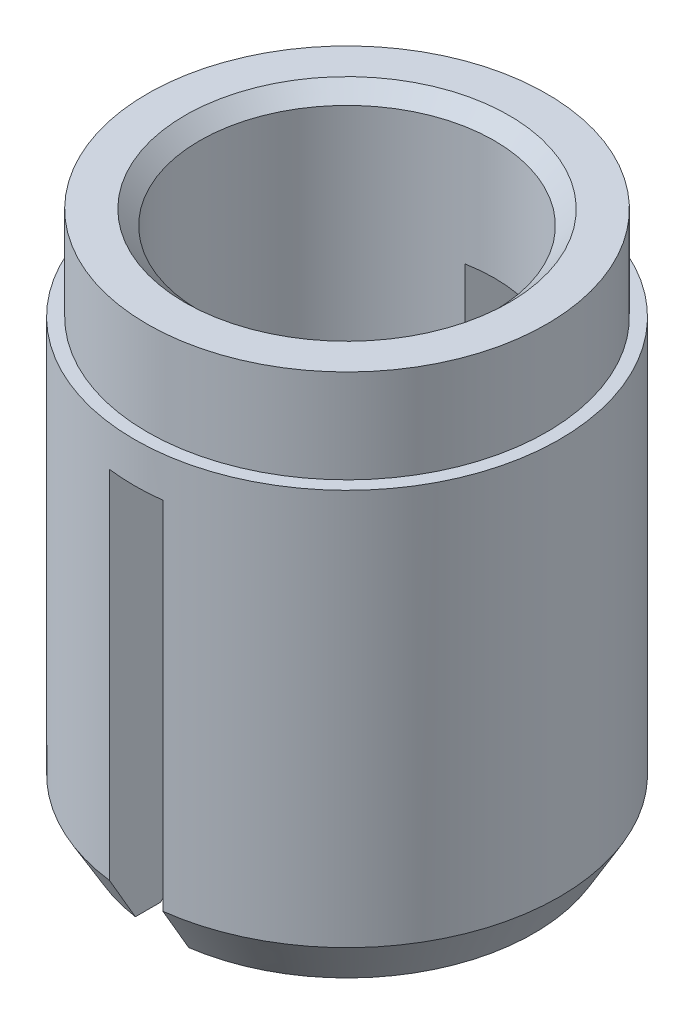
ISO-10303-21;
HEADER;
FILE_DESCRIPTION(('STEP AP214'),'2;1');
FILE_NAME('part.step','',(''),(''),'','','');
FILE_SCHEMA(('AUTOMOTIVE_DESIGN { 1 0 10303 214 1 1 1 1 }'));
ENDSEC;
DATA;
#1=APPLICATION_CONTEXT('core data for automotive mechanical design processes');
#2=APPLICATION_PROTOCOL_DEFINITION('international standard','automotive_design',2000,#1);
#3=PRODUCT_CONTEXT('',#1,'mechanical');
#4=PRODUCT('Part','Part','',(#3));
#5=PRODUCT_RELATED_PRODUCT_CATEGORY('part','',(#4));
#6=PRODUCT_DEFINITION_FORMATION('','',#4);
#7=PRODUCT_DEFINITION_CONTEXT('part definition',#1,'design');
#8=PRODUCT_DEFINITION('design','',#6,#7);
#9=PRODUCT_DEFINITION_SHAPE('','',#8);
#10=(LENGTH_UNIT() NAMED_UNIT(*) SI_UNIT(.MILLI.,.METRE.));
#11=(NAMED_UNIT(*) PLANE_ANGLE_UNIT() SI_UNIT($,.RADIAN.));
#12=(NAMED_UNIT(*) SI_UNIT($,.STERADIAN.) SOLID_ANGLE_UNIT());
#13=UNCERTAINTY_MEASURE_WITH_UNIT(LENGTH_MEASURE(1.E-05),#10,'distance_accuracy_value','');
#14=(GEOMETRIC_REPRESENTATION_CONTEXT(3) GLOBAL_UNCERTAINTY_ASSIGNED_CONTEXT((#13)) GLOBAL_UNIT_ASSIGNED_CONTEXT((#10,
#11,#12)) REPRESENTATION_CONTEXT('',''));
#15=CARTESIAN_POINT('',(0.,0.,0.));
#16=DIRECTION('',(0.,0.,1.));
#17=DIRECTION('',(1.,0.,0.));
#18=AXIS2_PLACEMENT_3D('',#15,#16,#17);
#19=CARTESIAN_POINT('',(0.,3.175,0.));
#20=DIRECTION('',(0.,-1.,0.));
#21=DIRECTION('',(0.,0.,-1.));
#22=AXIS2_PLACEMENT_3D('',#19,#20,#21);
#23=CYLINDRICAL_SURFACE('',#22,2.5273);
#24=CARTESIAN_POINT('',(0.,2.06375,0.));
#25=DIRECTION('',(0.,1.,0.));
#26=DIRECTION('',(0.,0.,1.));
#27=AXIS2_PLACEMENT_3D('',#24,#25,#26);
#28=CIRCLE('',#27,2.5273);
#29=CARTESIAN_POINT('',(0.,2.06375,2.5273));
#30=VERTEX_POINT('',#29);
#31=EDGE_CURVE('E163',#30,#30,#28,.T.);
#32=ORIENTED_EDGE('',*,*,#31,.F.);
#33=EDGE_LOOP('',(#32));
#34=FACE_BOUND('',#33,.T.);
#35=DIRECTION('',(0.,-1.,0.));
#36=VECTOR('',#35,1.);
#37=CARTESIAN_POINT('',(0.317500000000001,3.175,-2.50727721642422));
#38=LINE('',#37,#36);
#39=CARTESIAN_POINT('',(0.3175,1.5875,-2.50727721642422));
#40=VERTEX_POINT('',#39);
#41=CARTESIAN_POINT('',(0.317499999999999,-2.64707091385299,-2.50727721642422));
#42=VERTEX_POINT('',#41);
#43=EDGE_CURVE('E51',#40,#42,#38,.T.);
#44=ORIENTED_EDGE('',*,*,#43,.F.);
#45=CARTESIAN_POINT('',(0.,1.5875,0.));
#46=DIRECTION('',(0.,-1.,0.));
#47=DIRECTION('',(0.,0.,-1.));
#48=AXIS2_PLACEMENT_3D('',#45,#46,#47);
#49=CIRCLE('',#48,2.5273);
#50=CARTESIAN_POINT('',(-0.3175,1.5875,-2.50727721642422));
#51=VERTEX_POINT('',#50);
#52=EDGE_CURVE('E225',#51,#40,#49,.T.);
#53=ORIENTED_EDGE('',*,*,#52,.F.);
#54=DIRECTION('',(0.,-1.,0.));
#55=VECTOR('',#54,1.);
#56=CARTESIAN_POINT('',(-0.3175,3.175,-2.50727721642422));
#57=LINE('',#56,#55);
#58=CARTESIAN_POINT('',(-0.317499999999999,-2.64707091385299,-2.50727721642422));
#59=VERTEX_POINT('',#58);
#60=EDGE_CURVE('E217',#59,#51,#57,.F.);
#61=ORIENTED_EDGE('',*,*,#60,.F.);
#62=CARTESIAN_POINT('',(0.,-2.64707091385299,0.));
#63=DIRECTION('',(0.,1.,0.));
#64=DIRECTION('',(0.,0.,1.));
#65=AXIS2_PLACEMENT_3D('',#62,#63,#64);
#66=CIRCLE('',#65,2.5273);
#67=CARTESIAN_POINT('',(-0.317499999999999,-2.64707091385299,2.50727721642422));
#68=VERTEX_POINT('',#67);
#69=EDGE_CURVE('E159',#59,#68,#66,.T.);
#70=ORIENTED_EDGE('',*,*,#69,.T.);
#71=DIRECTION('',(0.,-1.,0.));
#72=VECTOR('',#71,1.);
#73=CARTESIAN_POINT('',(-0.3175,3.175,2.50727721642422));
#74=LINE('',#73,#72);
#75=CARTESIAN_POINT('',(-0.3175,1.5875,2.50727721642422));
#76=VERTEX_POINT('',#75);
#77=EDGE_CURVE('E273',#76,#68,#74,.T.);
#78=ORIENTED_EDGE('',*,*,#77,.F.);
#79=CARTESIAN_POINT('',(0.3175,1.5875,2.50727721642422));
#80=VERTEX_POINT('',#79);
#81=EDGE_CURVE('E154',#80,#76,#49,.T.);
#82=ORIENTED_EDGE('',*,*,#81,.F.);
#83=DIRECTION('',(0.,-1.,0.));
#84=VECTOR('',#83,1.);
#85=CARTESIAN_POINT('',(0.317500000000001,3.175,2.50727721642422));
#86=LINE('',#85,#84);
#87=CARTESIAN_POINT('',(0.317499999999999,-2.64707091385299,2.50727721642422));
#88=VERTEX_POINT('',#87);
#89=EDGE_CURVE('E250',#88,#80,#86,.F.);
#90=ORIENTED_EDGE('',*,*,#89,.F.);
#91=EDGE_CURVE('E162',#88,#42,#66,.T.);
#92=ORIENTED_EDGE('',*,*,#91,.T.);
#93=EDGE_LOOP('',(#44,#53,#61,#70,#78,#82,#90,#92));
#94=FACE_BOUND('',#93,.T.);
#95=ADVANCED_FACE('F35',(#34,#94),#23,.T.);
#96=CARTESIAN_POINT('',(0.,3.175,0.));
#97=DIRECTION('',(0.,-1.,0.));
#98=DIRECTION('',(0.,0.,-1.));
#99=AXIS2_PLACEMENT_3D('',#96,#97,#98);
#100=CYLINDRICAL_SURFACE('',#99,1.7526);
#101=CARTESIAN_POINT('',(0.,3.00277247766634,0.));
#102=DIRECTION('',(0.,1.,0.));
#103=DIRECTION('',(0.,0.,1.));
#104=AXIS2_PLACEMENT_3D('',#101,#102,#103);
#105=CIRCLE('',#104,1.7526);
#106=CARTESIAN_POINT('',(0.,3.00277247766634,1.7526));
#107=VERTEX_POINT('',#106);
#108=EDGE_CURVE('E157',#107,#107,#105,.F.);
#109=ORIENTED_EDGE('',*,*,#108,.F.);
#110=EDGE_LOOP('',(#109));
#111=FACE_BOUND('',#110,.T.);
#112=CARTESIAN_POINT('',(0.,1.5875,0.));
#113=DIRECTION('',(0.,-1.,0.));
#114=DIRECTION('',(0.,0.,-1.));
#115=AXIS2_PLACEMENT_3D('',#112,#113,#114);
#116=CIRCLE('',#115,1.7526);
#117=CARTESIAN_POINT('',(0.3175,1.5875,1.723601029821));
#118=VERTEX_POINT('',#117);
#119=CARTESIAN_POINT('',(-0.3175,1.5875,1.723601029821));
#120=VERTEX_POINT('',#119);
#121=EDGE_CURVE('E11',#118,#120,#116,.T.);
#122=ORIENTED_EDGE('',*,*,#121,.T.);
#123=DIRECTION('',(0.,-1.,0.));
#124=VECTOR('',#123,1.);
#125=CARTESIAN_POINT('',(-0.3175,3.175,1.723601029821));
#126=LINE('',#125,#124);
#127=CARTESIAN_POINT('',(-0.317499999999999,-3.00277247766634,1.723601029821));
#128=VERTEX_POINT('',#127);
#129=EDGE_CURVE('E222',#120,#128,#126,.T.);
#130=ORIENTED_EDGE('',*,*,#129,.T.);
#131=CARTESIAN_POINT('',(0.,-3.00277247766634,0.));
#132=DIRECTION('',(0.,-1.,0.));
#133=DIRECTION('',(0.,0.,-1.));
#134=AXIS2_PLACEMENT_3D('',#131,#132,#133);
#135=CIRCLE('',#134,1.7526);
#136=CARTESIAN_POINT('',(-0.317499999999999,-3.00277247766634,-1.723601029821));
#137=VERTEX_POINT('',#136);
#138=EDGE_CURVE('E151',#137,#128,#135,.F.);
#139=ORIENTED_EDGE('',*,*,#138,.F.);
#140=DIRECTION('',(0.,-1.,0.));
#141=VECTOR('',#140,1.);
#142=CARTESIAN_POINT('',(-0.3175,3.175,-1.723601029821));
#143=LINE('',#142,#141);
#144=CARTESIAN_POINT('',(-0.3175,1.5875,-1.723601029821));
#145=VERTEX_POINT('',#144);
#146=EDGE_CURVE('E216',#137,#145,#143,.F.);
#147=ORIENTED_EDGE('',*,*,#146,.T.);
#148=CARTESIAN_POINT('',(0.3175,1.5875,-1.723601029821));
#149=VERTEX_POINT('',#148);
#150=EDGE_CURVE('E40',#145,#149,#116,.T.);
#151=ORIENTED_EDGE('',*,*,#150,.T.);
#152=DIRECTION('',(0.,-1.,0.));
#153=VECTOR('',#152,1.);
#154=CARTESIAN_POINT('',(0.317500000000001,3.175,-1.723601029821));
#155=LINE('',#154,#153);
#156=CARTESIAN_POINT('',(0.317499999999999,-3.00277247766634,-1.723601029821));
#157=VERTEX_POINT('',#156);
#158=EDGE_CURVE('E272',#149,#157,#155,.T.);
#159=ORIENTED_EDGE('',*,*,#158,.T.);
#160=CARTESIAN_POINT('',(0.317499999999999,-3.00277247766634,1.723601029821));
#161=VERTEX_POINT('',#160);
#162=EDGE_CURVE('E148',#161,#157,#135,.F.);
#163=ORIENTED_EDGE('',*,*,#162,.F.);
#164=DIRECTION('',(0.,-1.,0.));
#165=VECTOR('',#164,1.);
#166=CARTESIAN_POINT('',(0.317500000000001,3.175,1.723601029821));
#167=LINE('',#166,#165);
#168=EDGE_CURVE('E128',#161,#118,#167,.F.);
#169=ORIENTED_EDGE('',*,*,#168,.T.);
#170=EDGE_LOOP('',(#122,#130,#139,#147,#151,#159,#163,#169));
#171=FACE_BOUND('',#170,.T.);
#172=ADVANCED_FACE('F244',(#111,#171),#100,.F.);
#173=CARTESIAN_POINT('',(0.,-3.175,0.));
#174=DIRECTION('',(0.,1.,0.));
#175=DIRECTION('',(0.,0.,1.));
#176=AXIS2_PLACEMENT_3D('',#173,#174,#175);
#177=PLANE('',#176);
#178=DIRECTION('',(0.,0.,-1.));
#179=VECTOR('',#178,1.);
#180=CARTESIAN_POINT('',(-0.317499999999999,-3.175,2.5273));
#181=LINE('',#180,#179);
#182=CARTESIAN_POINT('',(-0.317499999999999,-3.175,2.19970452561246));
#183=VERTEX_POINT('',#182);
#184=CARTESIAN_POINT('',(-0.317499999999999,-3.175,1.90153567665716));
#185=VERTEX_POINT('',#184);
#186=EDGE_CURVE('E251',#183,#185,#181,.T.);
#187=ORIENTED_EDGE('',*,*,#186,.F.);
#188=CARTESIAN_POINT('',(0.,-3.175,0.));
#189=DIRECTION('',(0.,1.,0.));
#190=DIRECTION('',(0.,0.,1.));
#191=AXIS2_PLACEMENT_3D('',#188,#189,#190);
#192=CIRCLE('',#191,2.22249999999999);
#193=CARTESIAN_POINT('',(-0.317499999999999,-3.175,-2.19970452561246));
#194=VERTEX_POINT('',#193);
#195=EDGE_CURVE('E164',#183,#194,#192,.F.);
#196=ORIENTED_EDGE('',*,*,#195,.T.);
#197=CARTESIAN_POINT('',(-0.317499999999999,-3.175,-1.90153567665716));
#198=VERTEX_POINT('',#197);
#199=EDGE_CURVE('E143',#198,#194,#181,.T.);
#200=ORIENTED_EDGE('',*,*,#199,.F.);
#201=CARTESIAN_POINT('',(0.,-3.175,0.));
#202=DIRECTION('',(0.,1.,0.));
#203=DIRECTION('',(0.,0.,1.));
#204=AXIS2_PLACEMENT_3D('',#201,#202,#203);
#205=CIRCLE('',#204,1.92786);
#206=EDGE_CURVE('E149',#198,#185,#205,.T.);
#207=ORIENTED_EDGE('',*,*,#206,.T.);
#208=EDGE_LOOP('',(#187,#196,#200,#207));
#209=FACE_BOUND('',#208,.T.);
#210=ADVANCED_FACE('F301',(#209),#177,.F.);
#211=DIRECTION('',(0.,0.,-1.));
#212=VECTOR('',#211,1.);
#213=CARTESIAN_POINT('',(0.317499999999999,-3.175,2.5273));
#214=LINE('',#213,#212);
#215=CARTESIAN_POINT('',(0.317499999999999,-3.175,-1.90153567665716));
#216=VERTEX_POINT('',#215);
#217=CARTESIAN_POINT('',(0.317499999999999,-3.175,-2.19970452561246));
#218=VERTEX_POINT('',#217);
#219=EDGE_CURVE('E144',#216,#218,#214,.T.);
#220=ORIENTED_EDGE('',*,*,#219,.T.);
#221=CARTESIAN_POINT('',(0.317499999999999,-3.175,2.19970452561246));
#222=VERTEX_POINT('',#221);
#223=EDGE_CURVE('E142',#218,#222,#192,.F.);
#224=ORIENTED_EDGE('',*,*,#223,.T.);
#225=CARTESIAN_POINT('',(0.317499999999999,-3.175,1.90153567665716));
#226=VERTEX_POINT('',#225);
#227=EDGE_CURVE('E59',#222,#226,#214,.T.);
#228=ORIENTED_EDGE('',*,*,#227,.T.);
#229=EDGE_CURVE('E140',#226,#216,#205,.T.);
#230=ORIENTED_EDGE('',*,*,#229,.T.);
#231=EDGE_LOOP('',(#220,#224,#228,#230));
#232=FACE_BOUND('',#231,.T.);
#233=ADVANCED_FACE('F139',(#232),#177,.F.);
#234=CARTESIAN_POINT('',(0.,-3.175,0.));
#235=DIRECTION('',(0.,-1.,0.));
#236=DIRECTION('',(0.,0.,-1.));
#237=AXIS2_PLACEMENT_3D('',#234,#235,#236);
#238=CONICAL_SURFACE('',#237,1.92786,0.794124809657422);
#239=CARTESIAN_POINT('',(-0.317499999999999,-5.46252179078327,4.24379877059259));
#240=CARTESIAN_POINT('',(-0.317499999999999,-5.31443369756718,4.09267816319377));
#241=CARTESIAN_POINT('',(-0.317499999999999,-5.16636439216439,3.94153912003483));
#242=CARTESIAN_POINT('',(-0.317499999999999,-4.87028399175995,3.6391926322881));
#243=CARTESIAN_POINT('',(-0.317499999999999,-4.72227289921881,3.48798518529094));
#244=CARTESIAN_POINT('',(-0.317499999999999,-4.42620490905018,3.18534291399634));
#245=CARTESIAN_POINT('',(-0.317499999999999,-4.27814809444854,3.03390800846909));
#246=CARTESIAN_POINT('',(-0.317499999999999,-3.98217928592847,2.73090777156038));
#247=CARTESIAN_POINT('',(-0.317499999999999,-3.83426728678755,2.57934244528274));
#248=CARTESIAN_POINT('',(-0.317499999999999,-3.54522819622682,2.28270864310126));
#249=CARTESIAN_POINT('',(-0.317499999999999,-3.40409100113407,2.13765001264966));
#250=CARTESIAN_POINT('',(-0.317499999999999,-3.12217114114297,1.8471575470586));
#251=CARTESIAN_POINT('',(-0.317499999999999,-2.98138851616585,1.70172367310175));
#252=CARTESIAN_POINT('',(-0.317499999999999,-2.77084187278659,1.48304818093191));
#253=CARTESIAN_POINT('',(-0.317499999999999,-2.70078406328826,1.41008974887184));
#254=CARTESIAN_POINT('',(-0.317499999999999,-2.56097999697679,1.26386886258359));
#255=CARTESIAN_POINT('',(-0.317499999999999,-2.49123375383245,1.19060639528377));
#256=CARTESIAN_POINT('',(-0.317499999999999,-2.35227069755042,1.04360612909373));
#257=CARTESIAN_POINT('',(-0.317499999999999,-2.28305378224454,0.969868427267113));
#258=CARTESIAN_POINT('',(-0.317499999999999,-2.1799765665701,0.858573034679068));
#259=CARTESIAN_POINT('',(-0.317499999999999,-2.14574338102152,0.821361087620718));
#260=CARTESIAN_POINT('',(-0.317499999999999,-2.07764602366073,0.746601478825787));
#261=CARTESIAN_POINT('',(-0.317499999999999,-2.04378184226508,0.709053825854196));
#262=CARTESIAN_POINT('',(-0.317499999999999,-1.992022051266,0.65078557631092));
#263=CARTESIAN_POINT('',(-0.317499999999999,-1.97392481065449,0.630244240661884));
#264=CARTESIAN_POINT('',(-0.317499999999999,-1.93794864645502,0.588967483297687));
#265=CARTESIAN_POINT('',(-0.317499999999999,-1.92006974355132,0.568232043517735));
#266=CARTESIAN_POINT('',(-0.317499999999999,-1.88447796272918,0.526361943117821));
#267=CARTESIAN_POINT('',(-0.317499999999999,-1.86676719172716,0.505225486702813));
#268=CARTESIAN_POINT('',(-0.317499999999999,-1.83176003804901,0.462619596524974));
#269=CARTESIAN_POINT('',(-0.317499999999999,-1.81446355215294,0.441150247945873));
#270=CARTESIAN_POINT('',(-0.317499999999999,-1.78031520814582,0.397569378302809));
#271=CARTESIAN_POINT('',(-0.317499999999999,-1.76346823914585,0.375454003442677));
#272=CARTESIAN_POINT('',(-0.317499999999999,-1.73067175626703,0.330569436978127));
#273=CARTESIAN_POINT('',(-0.317499999999999,-1.71472197361327,0.307800444301986));
#274=CARTESIAN_POINT('',(-0.317499999999999,-1.68432301063892,0.261456686234006));
#275=CARTESIAN_POINT('',(-0.317499999999999,-1.66986568841196,0.237887339924985));
#276=CARTESIAN_POINT('',(-0.317499999999999,-1.64330519450397,0.189480345929827));
#277=CARTESIAN_POINT('',(-0.317499999999999,-1.6311958002021,0.164646277197186));
#278=CARTESIAN_POINT('',(-0.317499999999999,-1.61336150258331,0.119368805687896));
#279=CARTESIAN_POINT('',(-0.317499999999999,-1.60680489380277,0.0992660205632469));
#280=CARTESIAN_POINT('',(-0.317499999999999,-1.59712527862505,0.0582968758900392));
#281=CARTESIAN_POINT('',(-0.317499999999999,-1.59398623260465,0.0374345623594283));
#282=CARTESIAN_POINT('',(-0.317499999999999,-1.59185008401529,-0.00469113609716895));
#283=CARTESIAN_POINT('',(-0.317499999999999,-1.59288742240452,-0.0259564106799356));
#284=CARTESIAN_POINT('',(-0.317499999999999,-1.59890661183045,-0.0679514321918662));
#285=CARTESIAN_POINT('',(-0.317499999999999,-1.60390189655121,-0.0886791065683908));
#286=CARTESIAN_POINT('',(-0.317499999999999,-1.61656949682041,-0.128427201628971));
#287=CARTESIAN_POINT('',(-0.317499999999999,-1.62413918320538,-0.147482204858517));
#288=CARTESIAN_POINT('',(-0.317499999999999,-1.64112343030447,-0.184765655812568));
#289=CARTESIAN_POINT('',(-0.317499999999999,-1.65054113394661,-0.202992629344861));
#290=CARTESIAN_POINT('',(-0.317499999999999,-1.67068809518401,-0.238893838637395));
#291=CARTESIAN_POINT('',(-0.317499999999999,-1.6814276664706,-0.256562174209163));
#292=CARTESIAN_POINT('',(-0.317499999999999,-1.70375107182301,-0.291330083739058));
#293=CARTESIAN_POINT('',(-0.317499999999999,-1.71533421315573,-0.308430107951451));
#294=CARTESIAN_POINT('',(-0.317499999999999,-1.75297627779142,-0.361974770809126));
#295=CARTESIAN_POINT('',(-0.317499999999999,-1.78011973371548,-0.397650981080428));
#296=CARTESIAN_POINT('',(-0.317499999999999,-1.83580333908077,-0.467903121035915));
#297=CARTESIAN_POINT('',(-0.317499999999999,-1.86434440033568,-0.502478307460051));
#298=CARTESIAN_POINT('',(-0.317499999999999,-1.92229756745167,-0.570998508727362));
#299=CARTESIAN_POINT('',(-0.317499999999999,-1.95171117189691,-0.604942254415968));
#300=CARTESIAN_POINT('',(-0.317499999999999,-2.01104391548656,-0.672364120851584));
#301=CARTESIAN_POINT('',(-0.317499999999999,-2.04096290296531,-0.70584237598115));
#302=CARTESIAN_POINT('',(-0.317499999999999,-2.13103273563293,-0.805607442565592));
#303=CARTESIAN_POINT('',(-0.317499999999999,-2.19168435519685,-0.871441327549293));
#304=CARTESIAN_POINT('',(-0.317499999999999,-2.31359403305543,-1.00240688710276));
#305=CARTESIAN_POINT('',(-0.317499999999999,-2.37485136087993,-1.06753924689045));
#306=CARTESIAN_POINT('',(-0.317499999999999,-2.56083246430779,-1.26411589591006));
#307=CARTESIAN_POINT('',(-0.317499999999999,-2.68615336860763,-1.39499472669986));
#308=CARTESIAN_POINT('',(-0.317499999999999,-2.93743151176878,-1.65614248366089));
#309=CARTESIAN_POINT('',(-0.317499999999999,-3.06338876622581,-1.78641139473192));
#310=CARTESIAN_POINT('',(-0.317499999999999,-3.31571727157404,-2.04668531879362));
#311=CARTESIAN_POINT('',(-0.317499999999999,-3.44208871017576,-2.17669015000655));
#312=CARTESIAN_POINT('',(-0.317499999999999,-3.6950272777193,-2.43650654795236));
#313=CARTESIAN_POINT('',(-0.317499999999999,-3.82159440474045,-2.56631811655787));
#314=CARTESIAN_POINT('',(-0.317499999999999,-4.07429174310052,-2.82524174688511));
#315=CARTESIAN_POINT('',(-0.317499999999999,-4.20042139618975,-2.95435435334336));
#316=CARTESIAN_POINT('',(-0.317499999999999,-4.45276477012023,-3.21249818609842));
#317=CARTESIAN_POINT('',(-0.317499999999999,-4.57897849123503,-3.34152941212774));
#318=CARTESIAN_POINT('',(-0.317499999999999,-4.83138968566227,-3.59945773318592));
#319=CARTESIAN_POINT('',(-0.317499999999999,-4.9575871240846,-3.72835486236049));
#320=CARTESIAN_POINT('',(-0.317499999999999,-5.21002545301873,-3.98610567666628));
#321=CARTESIAN_POINT('',(-0.317499999999999,-5.33626634337596,-4.11495936194889));
#322=CARTESIAN_POINT('',(-0.317499999999999,-5.46252179078327,-4.24379877059259));
#323=B_SPLINE_CURVE_WITH_KNOTS('',3,(#239,#240,#241,#242,#243,#244,#245,#246,#247,#248,#249,
#250,#251,#252,#253,#254,#255,#256,#257,#258,#259,#260,#261,#262,#263,#264,#265,#266,#267,#268,
#269,#270,#271,#272,#273,#274,#275,#276,#277,#278,#279,#280,#281,#282,#283,#284,#285,#286,#287,
#288,#289,#290,#291,#292,#293,#294,#295,#296,#297,#298,#299,#300,#301,#302,#303,#304,#305,#306,
#307,#308,#309,#310,#311,#312,#313,#314,#315,#316,#317,#318,#319,#320,#321,#322),.UNSPECIFIED.,
.F.,.F.,(4,2,2,2,2,2,2,2,2,2,2,2,2,2,2,2,2,2,2,2,2,2,2,2,2,2,2,2,2,2,2,2,2,2,2,2,2,2,2,2,2,4),
(0.,0.634750128813345,1.2695246948275,1.90488294496751,2.54021736963827,3.14738720003101,
3.7546225822665,4.05806754370605,4.36152568941646,4.66492370483229,4.81661201954686,
4.96829638530989,5.05042387033875,5.13255907630301,5.21528268261097,5.29798545913528,
5.38137547611173,5.4647403769732,5.547623347534,5.63028356058973,5.69350769955059,
5.75643381264859,5.81987991054129,5.88354227838687,5.94491736831283,6.00639775811255,
6.0683925128658,6.13033691991792,6.26473651074555,6.39922498501917,6.53395960016775,
6.66865447551275,6.93718379000543,7.2054213560168,7.74902284914556,8.29263773016631,
8.83654788985295,9.3804527445291,9.92194023972363,10.4634295054906,11.0045970918874,
11.5457627725028),.UNSPECIFIED.);
#324=EDGE_CURVE('E218',#185,#128,#323,.T.);
#325=ORIENTED_EDGE('',*,*,#324,.F.);
#326=ORIENTED_EDGE('',*,*,#206,.F.);
#327=EDGE_CURVE('E209',#137,#198,#323,.T.);
#328=ORIENTED_EDGE('',*,*,#327,.F.);
#329=ORIENTED_EDGE('',*,*,#138,.T.);
#330=EDGE_LOOP('',(#325,#326,#328,#329));
#331=FACE_BOUND('',#330,.T.);
#332=ADVANCED_FACE('F200',(#331),#238,.F.);
#333=CARTESIAN_POINT('',(0.317499999999998,-5.46252179078327,-4.24379877059259));
#334=CARTESIAN_POINT('',(0.317499999999998,-5.31443369756718,-4.09267816319377));
#335=CARTESIAN_POINT('',(0.317499999999998,-5.16636439216439,-3.94153912003483));
#336=CARTESIAN_POINT('',(0.317499999999999,-4.87028399175995,-3.6391926322881));
#337=CARTESIAN_POINT('',(0.317499999999999,-4.72227289921881,-3.48798518529094));
#338=CARTESIAN_POINT('',(0.317499999999999,-4.42620490905018,-3.18534291399634));
#339=CARTESIAN_POINT('',(0.317499999999999,-4.27814809444854,-3.03390800846909));
#340=CARTESIAN_POINT('',(0.317499999999999,-3.98217928592847,-2.73090777156038));
#341=CARTESIAN_POINT('',(0.317499999999999,-3.83426728678755,-2.57934244528274));
#342=CARTESIAN_POINT('',(0.317499999999999,-3.54522819622682,-2.28270864310126));
#343=CARTESIAN_POINT('',(0.317499999999999,-3.40409100113407,-2.13765001264966));
#344=CARTESIAN_POINT('',(0.317499999999999,-3.12217114114297,-1.84715754705861));
#345=CARTESIAN_POINT('',(0.317499999999999,-2.98138851616585,-1.70172367310175));
#346=CARTESIAN_POINT('',(0.317499999999999,-2.77084187278659,-1.48304818093191));
#347=CARTESIAN_POINT('',(0.317499999999999,-2.70078406328826,-1.41008974887185));
#348=CARTESIAN_POINT('',(0.317499999999999,-2.56097999697679,-1.26386886258359));
#349=CARTESIAN_POINT('',(0.317499999999999,-2.49123375383245,-1.19060639528377));
#350=CARTESIAN_POINT('',(0.317499999999999,-2.35227069755042,-1.04360612909373));
#351=CARTESIAN_POINT('',(0.317499999999999,-2.28305378224454,-0.969868427267114));
#352=CARTESIAN_POINT('',(0.317499999999999,-2.1799765665701,-0.858573034679069));
#353=CARTESIAN_POINT('',(0.317499999999999,-2.14574338102152,-0.821361087620718));
#354=CARTESIAN_POINT('',(0.317499999999999,-2.07764602366073,-0.746601478825787));
#355=CARTESIAN_POINT('',(0.317499999999999,-2.04378184226508,-0.709053825854196));
#356=CARTESIAN_POINT('',(0.317499999999999,-1.992022051266,-0.65078557631092));
#357=CARTESIAN_POINT('',(0.317499999999999,-1.97392481065449,-0.630244240661884));
#358=CARTESIAN_POINT('',(0.317499999999999,-1.93794864645502,-0.588967483297687));
#359=CARTESIAN_POINT('',(0.317499999999999,-1.92006974355132,-0.568232043517735));
#360=CARTESIAN_POINT('',(0.317499999999999,-1.88447796272918,-0.526361943117821));
#361=CARTESIAN_POINT('',(0.317499999999999,-1.86676719172716,-0.505225486702813));
#362=CARTESIAN_POINT('',(0.317499999999999,-1.83176003804901,-0.462619596524974));
#363=CARTESIAN_POINT('',(0.317499999999999,-1.81446355215294,-0.441150247945874));
#364=CARTESIAN_POINT('',(0.317499999999999,-1.78031520814582,-0.397569378302809));
#365=CARTESIAN_POINT('',(0.317499999999999,-1.76346823914585,-0.375454003442678));
#366=CARTESIAN_POINT('',(0.317499999999999,-1.73067175626703,-0.330569436978128));
#367=CARTESIAN_POINT('',(0.3175,-1.71472197361327,-0.307800444301987));
#368=CARTESIAN_POINT('',(0.3175,-1.68432301063892,-0.261456686234007));
#369=CARTESIAN_POINT('',(0.3175,-1.66986568841195,-0.237887339924986));
#370=CARTESIAN_POINT('',(0.3175,-1.64330519450397,-0.189480345929829));
#371=CARTESIAN_POINT('',(0.3175,-1.6311958002021,-0.164646277197187));
#372=CARTESIAN_POINT('',(0.3175,-1.61336150258331,-0.119368805687897));
#373=CARTESIAN_POINT('',(0.3175,-1.60680489380277,-0.0992660205632479));
#374=CARTESIAN_POINT('',(0.3175,-1.59712527862504,-0.0582968758900403));
#375=CARTESIAN_POINT('',(0.3175,-1.59398623260465,-0.0374345623594296));
#376=CARTESIAN_POINT('',(0.3175,-1.59185008401529,0.00469113609716728));
#377=CARTESIAN_POINT('',(0.3175,-1.59288742240452,0.025956410679934));
#378=CARTESIAN_POINT('',(0.3175,-1.59890661183045,0.0679514321918645));
#379=CARTESIAN_POINT('',(0.3175,-1.60390189655121,0.0886791065683891));
#380=CARTESIAN_POINT('',(0.3175,-1.61656949682041,0.128427201628969));
#381=CARTESIAN_POINT('',(0.3175,-1.62413918320538,0.147482204858515));
#382=CARTESIAN_POINT('',(0.3175,-1.64112343030447,0.184765655812565));
#383=CARTESIAN_POINT('',(0.3175,-1.65054113394661,0.202992629344858));
#384=CARTESIAN_POINT('',(0.3175,-1.670688095184,0.238893838637392));
#385=CARTESIAN_POINT('',(0.3175,-1.6814276664706,0.256562174209159));
#386=CARTESIAN_POINT('',(0.3175,-1.703751071823,0.291330083739054));
#387=CARTESIAN_POINT('',(0.3175,-1.71533421315572,0.308430107951446));
#388=CARTESIAN_POINT('',(0.3175,-1.75297627779141,0.36197477080912));
#389=CARTESIAN_POINT('',(0.317499999999999,-1.78011973371548,0.397650981080422));
#390=CARTESIAN_POINT('',(0.317499999999999,-1.83580333908076,0.467903121035908));
#391=CARTESIAN_POINT('',(0.317499999999999,-1.86434440033568,0.502478307460043));
#392=CARTESIAN_POINT('',(0.317499999999999,-1.92229756745166,0.570998508727353));
#393=CARTESIAN_POINT('',(0.317499999999999,-1.9517111718969,0.604942254415959));
#394=CARTESIAN_POINT('',(0.317499999999999,-2.01104391548655,0.672364120851573));
#395=CARTESIAN_POINT('',(0.317499999999999,-2.0409629029653,0.70584237598114));
#396=CARTESIAN_POINT('',(0.317499999999999,-2.13103273563291,0.80560744256558));
#397=CARTESIAN_POINT('',(0.317499999999999,-2.19168435519684,0.87144132754928));
#398=CARTESIAN_POINT('',(0.317499999999999,-2.31359403305541,1.00240688710274));
#399=CARTESIAN_POINT('',(0.317499999999999,-2.37485136087992,1.06753924689044));
#400=CARTESIAN_POINT('',(0.317499999999999,-2.56083246430778,1.26411589591004));
#401=CARTESIAN_POINT('',(0.317499999999999,-2.68615336860761,1.39499472669985));
#402=CARTESIAN_POINT('',(0.317499999999999,-2.93743151176876,1.65614248366088));
#403=CARTESIAN_POINT('',(0.317499999999999,-3.0633887662258,1.78641139473191));
#404=CARTESIAN_POINT('',(0.317499999999999,-3.31571727157403,2.04668531879361));
#405=CARTESIAN_POINT('',(0.317499999999999,-3.44208871017575,2.17669015000654));
#406=CARTESIAN_POINT('',(0.317499999999999,-3.69502727771929,2.43650654795235));
#407=CARTESIAN_POINT('',(0.317499999999999,-3.82159440474044,2.56631811655786));
#408=CARTESIAN_POINT('',(0.317499999999999,-4.07429174310051,2.8252417468851));
#409=CARTESIAN_POINT('',(0.317499999999999,-4.20042139618974,2.95435435334336));
#410=CARTESIAN_POINT('',(0.317499999999999,-4.45276477012022,3.21249818609842));
#411=CARTESIAN_POINT('',(0.317499999999999,-4.57897849123502,3.34152941212774));
#412=CARTESIAN_POINT('',(0.317499999999999,-4.83138968566227,3.59945773318591));
#413=CARTESIAN_POINT('',(0.317499999999999,-4.95758712408459,3.72835486236049));
#414=CARTESIAN_POINT('',(0.317499999999998,-5.21002545301873,3.98610567666628));
#415=CARTESIAN_POINT('',(0.317499999999998,-5.33626634337596,4.11495936194889));
#416=CARTESIAN_POINT('',(0.317499999999998,-5.46252179078327,4.24379877059259));
#417=B_SPLINE_CURVE_WITH_KNOTS('',3,(#333,#334,#335,#336,#337,#338,#339,#340,#341,#342,#343,
#344,#345,#346,#347,#348,#349,#350,#351,#352,#353,#354,#355,#356,#357,#358,#359,#360,#361,#362,
#363,#364,#365,#366,#367,#368,#369,#370,#371,#372,#373,#374,#375,#376,#377,#378,#379,#380,#381,
#382,#383,#384,#385,#386,#387,#388,#389,#390,#391,#392,#393,#394,#395,#396,#397,#398,#399,#400,
#401,#402,#403,#404,#405,#406,#407,#408,#409,#410,#411,#412,#413,#414,#415,#416),.UNSPECIFIED.,
.F.,.F.,(4,2,2,2,2,2,2,2,2,2,2,2,2,2,2,2,2,2,2,2,2,2,2,2,2,2,2,2,2,2,2,2,2,2,2,2,2,2,2,2,2,4),
(0.,0.634750128813344,1.2695246948275,1.90488294496751,2.54021736963826,3.14738720003101,
3.7546225822665,4.05806754370605,4.36152568941646,4.66492370483229,4.81661201954686,
4.96829638530989,5.05042387033875,5.13255907630301,5.21528268261097,5.29798545913528,
5.38137547611173,5.4647403769732,5.547623347534,5.63028356058973,5.6935076995506,
5.75643381264859,5.81987991054129,5.88354227838687,5.94491736831283,6.00639775811255,
6.06839251286579,6.13033691991792,6.26473651074554,6.39922498501916,6.53395960016774,
6.66865447551274,6.93718379000542,7.20542135601678,7.74902284914555,8.2926377301663,
8.83654788985294,9.38045274452909,9.92194023972362,10.4634295054906,11.0045970918874,
11.5457627725028),.UNSPECIFIED.);
#418=EDGE_CURVE('E134',#216,#157,#417,.T.);
#419=ORIENTED_EDGE('',*,*,#418,.F.);
#420=ORIENTED_EDGE('',*,*,#229,.F.);
#421=EDGE_CURVE('E124',#161,#226,#417,.T.);
#422=ORIENTED_EDGE('',*,*,#421,.F.);
#423=ORIENTED_EDGE('',*,*,#162,.T.);
#424=EDGE_LOOP('',(#419,#420,#422,#423));
#425=FACE_BOUND('',#424,.T.);
#426=ADVANCED_FACE('F147',(#425),#238,.F.);
#427=CARTESIAN_POINT('',(0.,-2.64707091385299,0.));
#428=DIRECTION('',(0.,1.,0.));
#429=DIRECTION('',(0.,0.,1.));
#430=AXIS2_PLACEMENT_3D('',#427,#428,#429);
#431=CONICAL_SURFACE('',#430,2.5273,0.523598775598301);
#432=ORIENTED_EDGE('',*,*,#69,.F.);
#433=CARTESIAN_POINT('',(-0.317499999999999,-0.505865492408337,-3.75010908352361));
#434=CARTESIAN_POINT('',(-0.317499999999999,-0.723091250513848,-3.62424179946621));
#435=CARTESIAN_POINT('',(-0.317499999999999,-0.940300121960934,-3.49834534165661));
#436=CARTESIAN_POINT('',(-0.317499999999999,-1.3746618872404,-3.24645934771415));
#437=CARTESIAN_POINT('',(-0.317499999999999,-1.59181478144788,-3.1204698122281));
#438=CARTESIAN_POINT('',(-0.317499999999999,-2.02603891398388,-2.86836495382324));
#439=CARTESIAN_POINT('',(-0.317499999999999,-2.24311015455154,-2.74224963476214));
#440=CARTESIAN_POINT('',(-0.317499999999999,-2.67714080350494,-2.48982326200087));
#441=CARTESIAN_POINT('',(-0.317499999999999,-2.8941002111133,-2.3635122069639));
#442=CARTESIAN_POINT('',(-0.317499999999999,-3.32785301661103,-2.1105780703705));
#443=CARTESIAN_POINT('',(-0.317499999999999,-3.54464640484717,-1.98395497224475));
#444=CARTESIAN_POINT('',(-0.317499999999999,-3.86959893268123,-1.79361920939393));
#445=CARTESIAN_POINT('',(-0.317499999999999,-3.97787585580095,-1.7301076878754));
#446=CARTESIAN_POINT('',(-0.317499999999999,-4.19431991736886,-1.60289653326547));
#447=CARTESIAN_POINT('',(-0.317499999999999,-4.30248705526032,-1.53919689922649));
#448=CARTESIAN_POINT('',(-0.317499999999999,-4.5186703333103,-1.41152652627493));
#449=CARTESIAN_POINT('',(-0.317499999999999,-4.62668646378091,-1.34755577094245));
#450=CARTESIAN_POINT('',(-0.317499999999999,-4.8424781341485,-1.21921291231415));
#451=CARTESIAN_POINT('',(-0.317499999999999,-4.95025367737697,-1.15484081462325));
#452=CARTESIAN_POINT('',(-0.317499999999999,-5.16542860134754,-1.02545309314839));
#453=CARTESIAN_POINT('',(-0.317499999999999,-5.2728279573828,-0.96043742813134));
#454=CARTESIAN_POINT('',(-0.317499999999999,-5.43340989814399,-0.862062416902513));
#455=CARTESIAN_POINT('',(-0.317499999999999,-5.4868522888496,-0.829128037610404));
#456=CARTESIAN_POINT('',(-0.317499999999999,-5.59347960800156,-0.762842700127671));
#457=CARTESIAN_POINT('',(-0.317499999999999,-5.64666453033244,-0.729491732108791));
#458=CARTESIAN_POINT('',(-0.317499999999999,-5.69967733403095,-0.695866627580947));
#459=B_SPLINE_CURVE_WITH_KNOTS('',3,(#433,#434,#435,#436,#437,#438,#439,#440,#441,#442,#443,
#444,#445,#446,#447,#448,#449,#450,#451,#452,#453,#454,#455,#456,#457,#458),.UNSPECIFIED.,.F.,
.F.,(4,2,2,2,2,2,2,2,2,2,2,2,4),(0.,0.75317093556194,1.5063366855181,2.25948000600538,
3.01262849300567,3.76581787273017,4.14240564261015,4.51899531272889,4.89560812577641,
5.27221569099094,5.64884754350879,5.8371723886256,6.025501685168),.UNSPECIFIED.);
#460=EDGE_CURVE('E278',#59,#194,#459,.T.);
#461=ORIENTED_EDGE('',*,*,#460,.T.);
#462=ORIENTED_EDGE('',*,*,#195,.F.);
#463=CARTESIAN_POINT('',(-0.317499999999999,-5.69967733403095,0.695866627580947));
#464=CARTESIAN_POINT('',(-0.317499999999999,-5.62787821311707,0.741379044923943));
#465=CARTESIAN_POINT('',(-0.317499999999999,-5.55578382451724,0.786419112350712));
#466=CARTESIAN_POINT('',(-0.317499999999999,-5.41117626054808,0.875816780117049));
#467=CARTESIAN_POINT('',(-0.317499999999999,-5.33866310077685,0.920174405653105));
#468=CARTESIAN_POINT('',(-0.317499999999999,-5.19338888404735,1.00847002891333));
#469=CARTESIAN_POINT('',(-0.317499999999999,-5.12062784265597,1.05240805235253));
#470=CARTESIAN_POINT('',(-0.317499999999999,-4.97492616397213,1.13998714641421));
#471=CARTESIAN_POINT('',(-0.317499999999999,-4.90198552464787,1.18362821365594));
#472=CARTESIAN_POINT('',(-0.317499999999999,-4.68635471123983,1.31222449521334));
#473=CARTESIAN_POINT('',(-0.317499999999999,-4.54348956678207,1.39688606598698));
#474=CARTESIAN_POINT('',(-0.317499999999999,-4.25748968457837,1.56575286078497));
#475=CARTESIAN_POINT('',(-0.317499999999999,-4.11435494590231,1.64995808323103));
#476=CARTESIAN_POINT('',(-0.317499999999999,-3.68468616885083,1.90216023645302));
#477=CARTESIAN_POINT('',(-0.317499999999999,-3.397903854931,2.06973400760367));
#478=CARTESIAN_POINT('',(-0.317499999999999,-2.89408349537417,2.36351843164253));
#479=CARTESIAN_POINT('',(-0.317499999999999,-2.67711009560288,2.48984019207318));
#480=CARTESIAN_POINT('',(-0.317499999999999,-2.24304847357912,2.74228643678766));
#481=CARTESIAN_POINT('',(-0.317499999999999,-2.02596025131132,2.86841092104514));
#482=CARTESIAN_POINT('',(-0.317499999999999,-1.59173428367062,3.12051625144922));
#483=CARTESIAN_POINT('',(-0.317499999999999,-1.37459654701819,3.24649711262318));
#484=CARTESIAN_POINT('',(-0.317499999999999,-0.940266726692459,3.4983648337778));
#485=CARTESIAN_POINT('',(-0.317499999999999,-0.72307464305062,3.62425169381272));
#486=CARTESIAN_POINT('',(-0.317499999999999,-0.505865492408337,3.75010908352361));
#487=B_SPLINE_CURVE_WITH_KNOTS('',3,(#463,#464,#465,#466,#467,#468,#469,#470,#471,#472,#473,
#474,#475,#476,#477,#478,#479,#480,#481,#482,#483,#484,#485,#486),.UNSPECIFIED.,.F.,.F.,(4,2,2,
2,2,2,2,2,2,2,2,4),(0.,0.25501958817121,0.51002973803905,0.765024158173895,1.02002147648185,
1.51821878853719,2.01641782252566,3.01287267270638,3.76607372069575,4.51927486928841,
5.27238823499195,6.02550116570545),.UNSPECIFIED.);
#488=EDGE_CURVE('E282',#183,#68,#487,.T.);
#489=ORIENTED_EDGE('',*,*,#488,.T.);
#490=EDGE_LOOP('',(#432,#461,#462,#489));
#491=FACE_BOUND('',#490,.T.);
#492=ADVANCED_FACE('F37',(#491),#431,.T.);
#493=ORIENTED_EDGE('',*,*,#223,.F.);
#494=CARTESIAN_POINT('',(0.317499999999998,-5.69967733403095,-0.695866627580948));
#495=CARTESIAN_POINT('',(0.317499999999998,-5.62787821311707,-0.741379044923942));
#496=CARTESIAN_POINT('',(0.317499999999998,-5.55578382451724,-0.786419112350711));
#497=CARTESIAN_POINT('',(0.317499999999998,-5.41117626054808,-0.875816780117048));
#498=CARTESIAN_POINT('',(0.317499999999998,-5.33866310077685,-0.920174405653105));
#499=CARTESIAN_POINT('',(0.317499999999998,-5.19338888404736,-1.00847002891333));
#500=CARTESIAN_POINT('',(0.317499999999999,-5.12062784265597,-1.05240805235253));
#501=CARTESIAN_POINT('',(0.317499999999999,-4.97492616397213,-1.13998714641421));
#502=CARTESIAN_POINT('',(0.317499999999999,-4.90198552464787,-1.18362821365594));
#503=CARTESIAN_POINT('',(0.317499999999999,-4.68635471123983,-1.31222449521334));
#504=CARTESIAN_POINT('',(0.317499999999999,-4.54348956678207,-1.39688606598698));
#505=CARTESIAN_POINT('',(0.317499999999999,-4.25748968457837,-1.56575286078497));
#506=CARTESIAN_POINT('',(0.317499999999999,-4.11435494590231,-1.64995808323103));
#507=CARTESIAN_POINT('',(0.317499999999999,-3.68468616885083,-1.90216023645302));
#508=CARTESIAN_POINT('',(0.317499999999999,-3.397903854931,-2.06973400760367));
#509=CARTESIAN_POINT('',(0.317499999999999,-2.89408349537417,-2.36351843164253));
#510=CARTESIAN_POINT('',(0.317499999999999,-2.67711009560288,-2.48984019207318));
#511=CARTESIAN_POINT('',(0.317499999999999,-2.24304847357912,-2.74228643678766));
#512=CARTESIAN_POINT('',(0.317499999999999,-2.02596025131132,-2.86841092104514));
#513=CARTESIAN_POINT('',(0.3175,-1.59173428367062,-3.12051625144922));
#514=CARTESIAN_POINT('',(0.3175,-1.37459654701819,-3.24649711262318));
#515=CARTESIAN_POINT('',(0.3175,-0.940266726692458,-3.4983648337778));
#516=CARTESIAN_POINT('',(0.3175,-0.72307464305062,-3.62425169381272));
#517=CARTESIAN_POINT('',(0.3175,-0.505865492408337,-3.75010908352361));
#518=B_SPLINE_CURVE_WITH_KNOTS('',3,(#494,#495,#496,#497,#498,#499,#500,#501,#502,#503,#504,
#505,#506,#507,#508,#509,#510,#511,#512,#513,#514,#515,#516,#517),.UNSPECIFIED.,.F.,.F.,(4,2,2,
2,2,2,2,2,2,2,2,4),(0.,0.255019588171208,0.510029738039048,0.765024158173894,1.02002147648185,
1.51821878853719,2.01641782252566,3.01287267270638,3.76607372069575,4.51927486928841,
5.27238823499195,6.02550116570545),.UNSPECIFIED.);
#519=EDGE_CURVE('E174',#218,#42,#518,.T.);
#520=ORIENTED_EDGE('',*,*,#519,.T.);
#521=ORIENTED_EDGE('',*,*,#91,.F.);
#522=CARTESIAN_POINT('',(0.3175,-0.505865492408337,3.75010908352361));
#523=CARTESIAN_POINT('',(0.3175,-0.723091250513848,3.62424179946621));
#524=CARTESIAN_POINT('',(0.3175,-0.940300121960934,3.49834534165661));
#525=CARTESIAN_POINT('',(0.3175,-1.3746618872404,3.24645934771415));
#526=CARTESIAN_POINT('',(0.3175,-1.59181478144788,3.1204698122281));
#527=CARTESIAN_POINT('',(0.317499999999999,-2.02603891398388,2.86836495382324));
#528=CARTESIAN_POINT('',(0.317499999999999,-2.24311015455154,2.74224963476214));
#529=CARTESIAN_POINT('',(0.317499999999999,-2.67714080350494,2.48982326200087));
#530=CARTESIAN_POINT('',(0.317499999999999,-2.8941002111133,2.3635122069639));
#531=CARTESIAN_POINT('',(0.317499999999999,-3.32785301661103,2.1105780703705));
#532=CARTESIAN_POINT('',(0.317499999999999,-3.54464640484717,1.98395497224475));
#533=CARTESIAN_POINT('',(0.317499999999999,-3.86959893268123,1.79361920939393));
#534=CARTESIAN_POINT('',(0.317499999999999,-3.97787585580095,1.7301076878754));
#535=CARTESIAN_POINT('',(0.317499999999999,-4.19431991736886,1.60289653326547));
#536=CARTESIAN_POINT('',(0.317499999999999,-4.30248705526032,1.53919689922649));
#537=CARTESIAN_POINT('',(0.317499999999999,-4.5186703333103,1.41152652627493));
#538=CARTESIAN_POINT('',(0.317499999999999,-4.62668646378091,1.34755577094245));
#539=CARTESIAN_POINT('',(0.317499999999999,-4.8424781341485,1.21921291231415));
#540=CARTESIAN_POINT('',(0.317499999999999,-4.95025367737697,1.15484081462325));
#541=CARTESIAN_POINT('',(0.317499999999998,-5.16542860134754,1.02545309314839));
#542=CARTESIAN_POINT('',(0.317499999999998,-5.2728279573828,0.96043742813134));
#543=CARTESIAN_POINT('',(0.317499999999998,-5.43340989814399,0.862062416902513));
#544=CARTESIAN_POINT('',(0.317499999999998,-5.4868522888496,0.829128037610405));
#545=CARTESIAN_POINT('',(0.317499999999998,-5.59347960800156,0.762842700127671));
#546=CARTESIAN_POINT('',(0.317499999999998,-5.64666453033244,0.729491732108791));
#547=CARTESIAN_POINT('',(0.317499999999998,-5.69967733403095,0.695866627580948));
#548=B_SPLINE_CURVE_WITH_KNOTS('',3,(#522,#523,#524,#525,#526,#527,#528,#529,#530,#531,#532,
#533,#534,#535,#536,#537,#538,#539,#540,#541,#542,#543,#544,#545,#546,#547),.UNSPECIFIED.,.F.,
.F.,(4,2,2,2,2,2,2,2,2,2,2,2,4),(0.,0.753170935561939,1.5063366855181,2.25948000600538,
3.01262849300567,3.76581787273017,4.14240564261015,4.51899531272889,4.89560812577641,
5.27221569099094,5.64884754350879,5.8371723886256,6.025501685168),.UNSPECIFIED.);
#549=EDGE_CURVE('E167',#88,#222,#548,.T.);
#550=ORIENTED_EDGE('',*,*,#549,.T.);
#551=EDGE_LOOP('',(#493,#520,#521,#550));
#552=FACE_BOUND('',#551,.T.);
#553=ADVANCED_FACE('F293',(#552),#431,.T.);
#554=CARTESIAN_POINT('',(0.,3.175,0.));
#555=DIRECTION('',(0.,1.,0.));
#556=DIRECTION('',(0.,0.,1.));
#557=AXIS2_PLACEMENT_3D('',#554,#555,#556);
#558=PLANE('',#557);
#559=CARTESIAN_POINT('',(0.,3.175,0.));
#560=DIRECTION('',(0.,1.,0.));
#561=DIRECTION('',(0.,0.,1.));
#562=AXIS2_PLACEMENT_3D('',#559,#560,#561);
#563=CIRCLE('',#562,1.92786);
#564=CARTESIAN_POINT('',(0.,3.175,1.92786));
#565=VERTEX_POINT('',#564);
#566=EDGE_CURVE('E228',#565,#565,#563,.T.);
#567=ORIENTED_EDGE('',*,*,#566,.F.);
#568=EDGE_LOOP('',(#567));
#569=FACE_BOUND('',#568,.T.);
#570=CARTESIAN_POINT('',(0.,3.175,0.));
#571=DIRECTION('',(0.,1.,0.));
#572=DIRECTION('',(0.,0.,1.));
#573=AXIS2_PLACEMENT_3D('',#570,#571,#572);
#574=CIRCLE('',#573,2.3749);
#575=CARTESIAN_POINT('',(0.,3.175,2.3749));
#576=VERTEX_POINT('',#575);
#577=EDGE_CURVE('E232',#576,#576,#574,.T.);
#578=ORIENTED_EDGE('',*,*,#577,.T.);
#579=EDGE_LOOP('',(#578));
#580=FACE_BOUND('',#579,.T.);
#581=ADVANCED_FACE('F336',(#569,#580),#558,.T.);
#582=CARTESIAN_POINT('',(0.,2.06375,0.));
#583=DIRECTION('',(0.,1.,0.));
#584=DIRECTION('',(0.,0.,1.));
#585=AXIS2_PLACEMENT_3D('',#582,#583,#584);
#586=PLANE('',#585);
#587=ORIENTED_EDGE('',*,*,#31,.T.);
#588=EDGE_LOOP('',(#587));
#589=FACE_BOUND('',#588,.T.);
#590=CARTESIAN_POINT('',(0.,2.06375,0.));
#591=DIRECTION('',(0.,1.,0.));
#592=DIRECTION('',(0.,0.,1.));
#593=AXIS2_PLACEMENT_3D('',#590,#591,#592);
#594=CIRCLE('',#593,2.3749);
#595=CARTESIAN_POINT('',(0.,2.06375,2.3749));
#596=VERTEX_POINT('',#595);
#597=EDGE_CURVE('E231',#596,#596,#594,.T.);
#598=ORIENTED_EDGE('',*,*,#597,.F.);
#599=EDGE_LOOP('',(#598));
#600=FACE_BOUND('',#599,.T.);
#601=ADVANCED_FACE('F239',(#589,#600),#586,.T.);
#602=CARTESIAN_POINT('',(0.,3.175,0.));
#603=DIRECTION('',(0.,-1.,0.));
#604=DIRECTION('',(0.,0.,-1.));
#605=AXIS2_PLACEMENT_3D('',#602,#603,#604);
#606=CYLINDRICAL_SURFACE('',#605,2.3749);
#607=ORIENTED_EDGE('',*,*,#577,.F.);
#608=EDGE_LOOP('',(#607));
#609=FACE_BOUND('',#608,.T.);
#610=ORIENTED_EDGE('',*,*,#597,.T.);
#611=EDGE_LOOP('',(#610));
#612=FACE_BOUND('',#611,.T.);
#613=ADVANCED_FACE('F307',(#609,#612),#606,.T.);
#614=CARTESIAN_POINT('',(0.,3.175,0.));
#615=DIRECTION('',(0.,1.,0.));
#616=DIRECTION('',(0.,0.,1.));
#617=AXIS2_PLACEMENT_3D('',#614,#615,#616);
#618=CONICAL_SURFACE('',#617,1.92786,0.794124809657422);
#619=ORIENTED_EDGE('',*,*,#566,.T.);
#620=EDGE_LOOP('',(#619));
#621=FACE_BOUND('',#620,.T.);
#622=ORIENTED_EDGE('',*,*,#108,.T.);
#623=EDGE_LOOP('',(#622));
#624=FACE_BOUND('',#623,.T.);
#625=ADVANCED_FACE('F205',(#621,#624),#618,.F.);
#626=CARTESIAN_POINT('',(-0.3175,1.5875,2.5273));
#627=DIRECTION('',(1.,0.,0.));
#628=DIRECTION('',(0.,1.,0.));
#629=AXIS2_PLACEMENT_3D('',#626,#627,#628);
#630=PLANE('',#629);
#631=DIRECTION('',(0.,0.,-1.));
#632=VECTOR('',#631,1.);
#633=CARTESIAN_POINT('',(-0.3175,1.5875,2.5273));
#634=LINE('',#633,#632);
#635=EDGE_CURVE('E258',#76,#120,#634,.T.);
#636=ORIENTED_EDGE('',*,*,#635,.F.);
#637=ORIENTED_EDGE('',*,*,#77,.T.);
#638=ORIENTED_EDGE('',*,*,#488,.F.);
#639=ORIENTED_EDGE('',*,*,#186,.T.);
#640=ORIENTED_EDGE('',*,*,#324,.T.);
#641=ORIENTED_EDGE('',*,*,#129,.F.);
#642=EDGE_LOOP('',(#636,#637,#638,#639,#640,#641));
#643=FACE_BOUND('',#642,.T.);
#644=ADVANCED_FACE('F187',(#643),#630,.T.);
#645=CARTESIAN_POINT('',(0.3175,1.5875,2.5273));
#646=DIRECTION('',(-1.,0.,0.));
#647=DIRECTION('',(0.,-1.,0.));
#648=AXIS2_PLACEMENT_3D('',#645,#646,#647);
#649=PLANE('',#648);
#650=ORIENTED_EDGE('',*,*,#421,.T.);
#651=ORIENTED_EDGE('',*,*,#227,.F.);
#652=ORIENTED_EDGE('',*,*,#549,.F.);
#653=ORIENTED_EDGE('',*,*,#89,.T.);
#654=DIRECTION('',(0.,0.,-1.));
#655=VECTOR('',#654,1.);
#656=CARTESIAN_POINT('',(0.3175,1.5875,2.5273));
#657=LINE('',#656,#655);
#658=EDGE_CURVE('E255',#80,#118,#657,.T.);
#659=ORIENTED_EDGE('',*,*,#658,.T.);
#660=ORIENTED_EDGE('',*,*,#168,.F.);
#661=EDGE_LOOP('',(#650,#651,#652,#653,#659,#660));
#662=FACE_BOUND('',#661,.T.);
#663=ADVANCED_FACE('F125',(#662),#649,.T.);
#664=CARTESIAN_POINT('',(-0.3175,1.5875,2.5273));
#665=DIRECTION('',(0.,-1.,0.));
#666=DIRECTION('',(0.,0.,-1.));
#667=AXIS2_PLACEMENT_3D('',#664,#665,#666);
#668=PLANE('',#667);
#669=ORIENTED_EDGE('',*,*,#81,.T.);
#670=ORIENTED_EDGE('',*,*,#635,.T.);
#671=ORIENTED_EDGE('',*,*,#121,.F.);
#672=ORIENTED_EDGE('',*,*,#658,.F.);
#673=EDGE_LOOP('',(#669,#670,#671,#672));
#674=FACE_BOUND('',#673,.T.);
#675=ADVANCED_FACE('F186',(#674),#668,.T.);
#676=ORIENTED_EDGE('',*,*,#52,.T.);
#677=EDGE_CURVE('E256',#149,#40,#657,.T.);
#678=ORIENTED_EDGE('',*,*,#677,.F.);
#679=ORIENTED_EDGE('',*,*,#150,.F.);
#680=EDGE_CURVE('E259',#145,#51,#634,.T.);
#681=ORIENTED_EDGE('',*,*,#680,.T.);
#682=EDGE_LOOP('',(#676,#678,#679,#681));
#683=FACE_BOUND('',#682,.T.);
#684=ADVANCED_FACE('F295',(#683),#668,.T.);
#685=ORIENTED_EDGE('',*,*,#327,.T.);
#686=ORIENTED_EDGE('',*,*,#199,.T.);
#687=ORIENTED_EDGE('',*,*,#460,.F.);
#688=ORIENTED_EDGE('',*,*,#60,.T.);
#689=ORIENTED_EDGE('',*,*,#680,.F.);
#690=ORIENTED_EDGE('',*,*,#146,.F.);
#691=EDGE_LOOP('',(#685,#686,#687,#688,#689,#690));
#692=FACE_BOUND('',#691,.T.);
#693=ADVANCED_FACE('F185',(#692),#630,.T.);
#694=ORIENTED_EDGE('',*,*,#677,.T.);
#695=ORIENTED_EDGE('',*,*,#43,.T.);
#696=ORIENTED_EDGE('',*,*,#519,.F.);
#697=ORIENTED_EDGE('',*,*,#219,.F.);
#698=ORIENTED_EDGE('',*,*,#418,.T.);
#699=ORIENTED_EDGE('',*,*,#158,.F.);
#700=EDGE_LOOP('',(#694,#695,#696,#697,#698,#699));
#701=FACE_BOUND('',#700,.T.);
#702=ADVANCED_FACE('F180',(#701),#649,.T.);
#703=CLOSED_SHELL('',(#95,#172,#210,#233,#332,#426,#492,#553,#581,#601,#613,#625,#644,#663,#675,
#684,#693,#702));
#704=MANIFOLD_SOLID_BREP('B2',#703);
#705=ADVANCED_BREP_SHAPE_REPRESENTATION('',(#18,#704),#14);
#706=SHAPE_DEFINITION_REPRESENTATION(#9,#705);
ENDSEC;
END-ISO-10303-21;
